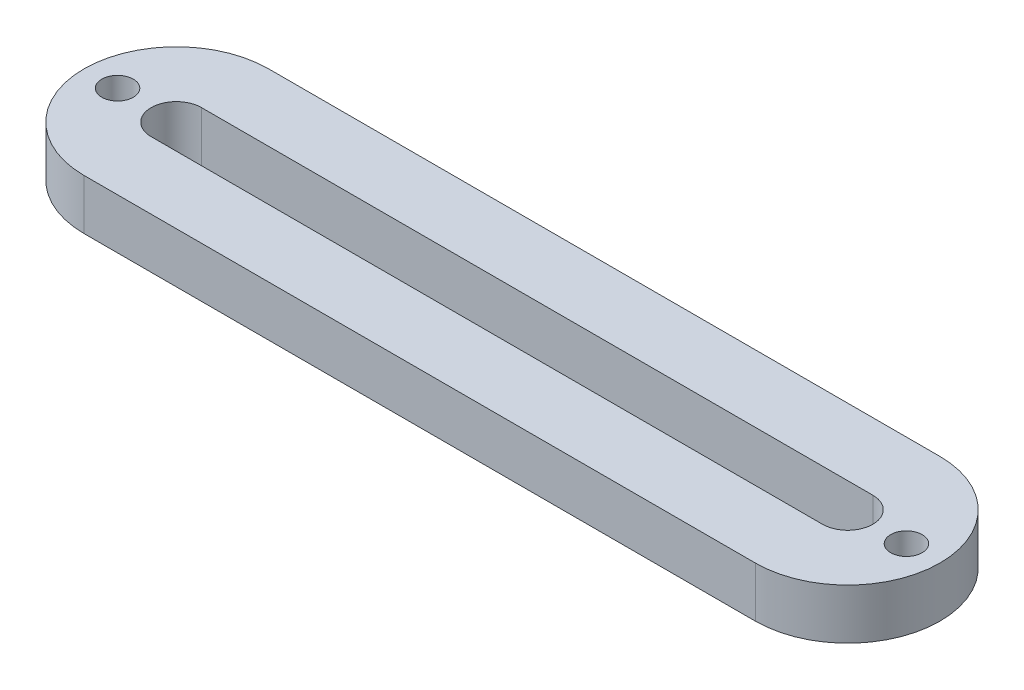
ISO-10303-21;
HEADER;
FILE_DESCRIPTION(('STEP AP214'),'2;1');
FILE_NAME('part.step','',(''),(''),'','','');
FILE_SCHEMA(('AUTOMOTIVE_DESIGN { 1 0 10303 214 1 1 1 1 }'));
ENDSEC;
DATA;
#1=APPLICATION_CONTEXT('core data for automotive mechanical design processes');
#2=APPLICATION_PROTOCOL_DEFINITION('international standard','automotive_design',2000,#1);
#3=PRODUCT_CONTEXT('',#1,'mechanical');
#4=PRODUCT('Part','Part','',(#3));
#5=PRODUCT_RELATED_PRODUCT_CATEGORY('part','',(#4));
#6=PRODUCT_DEFINITION_FORMATION('','',#4);
#7=PRODUCT_DEFINITION_CONTEXT('part definition',#1,'design');
#8=PRODUCT_DEFINITION('design','',#6,#7);
#9=PRODUCT_DEFINITION_SHAPE('','',#8);
#10=(LENGTH_UNIT() NAMED_UNIT(*) SI_UNIT(.MILLI.,.METRE.));
#11=(NAMED_UNIT(*) PLANE_ANGLE_UNIT() SI_UNIT($,.RADIAN.));
#12=(NAMED_UNIT(*) SI_UNIT($,.STERADIAN.) SOLID_ANGLE_UNIT());
#13=UNCERTAINTY_MEASURE_WITH_UNIT(LENGTH_MEASURE(1.E-05),#10,'distance_accuracy_value','');
#14=(GEOMETRIC_REPRESENTATION_CONTEXT(3) GLOBAL_UNCERTAINTY_ASSIGNED_CONTEXT((#13)) GLOBAL_UNIT_ASSIGNED_CONTEXT((#10,
#11,#12)) REPRESENTATION_CONTEXT('',''));
#15=CARTESIAN_POINT('',(0.,0.,0.));
#16=DIRECTION('',(0.,0.,1.));
#17=DIRECTION('',(1.,0.,0.));
#18=AXIS2_PLACEMENT_3D('',#15,#16,#17);
#19=CARTESIAN_POINT('',(-40.,6.,0.));
#20=DIRECTION('',(0.,1.,0.));
#21=DIRECTION('',(0.,0.,1.));
#22=AXIS2_PLACEMENT_3D('',#19,#20,#21);
#23=PLANE('',#22);
#24=CARTESIAN_POINT('',(-47.,6.,0.));
#25=DIRECTION('',(0.,1.,0.));
#26=DIRECTION('',(0.,0.,1.));
#27=AXIS2_PLACEMENT_3D('',#24,#25,#26);
#28=CIRCLE('',#27,1.875);
#29=CARTESIAN_POINT('',(-47.,6.,1.875));
#30=VERTEX_POINT('',#29);
#31=EDGE_CURVE('E126',#30,#30,#28,.T.);
#32=ORIENTED_EDGE('',*,*,#31,.F.);
#33=EDGE_LOOP('',(#32));
#34=FACE_BOUND('',#33,.T.);
#35=CARTESIAN_POINT('',(-40.,6.,0.));
#36=DIRECTION('',(0.,1.,0.));
#37=DIRECTION('',(0.,0.,1.));
#38=AXIS2_PLACEMENT_3D('',#35,#36,#37);
#39=CIRCLE('',#38,11.);
#40=CARTESIAN_POINT('',(-40.,6.,-11.));
#41=VERTEX_POINT('',#40);
#42=CARTESIAN_POINT('',(-40.,6.,11.));
#43=VERTEX_POINT('',#42);
#44=EDGE_CURVE('E136',#41,#43,#39,.T.);
#45=ORIENTED_EDGE('',*,*,#44,.T.);
#46=DIRECTION('',(1.,0.,0.));
#47=VECTOR('',#46,1.);
#48=CARTESIAN_POINT('',(-40.,6.,11.));
#49=LINE('',#48,#47);
#50=CARTESIAN_POINT('',(40.,6.,11.));
#51=VERTEX_POINT('',#50);
#52=EDGE_CURVE('E139',#43,#51,#49,.T.);
#53=ORIENTED_EDGE('',*,*,#52,.T.);
#54=CARTESIAN_POINT('',(40.,6.,0.));
#55=DIRECTION('',(0.,1.,0.));
#56=DIRECTION('',(0.,0.,1.));
#57=AXIS2_PLACEMENT_3D('',#54,#55,#56);
#58=CIRCLE('',#57,11.);
#59=CARTESIAN_POINT('',(40.,6.,-11.));
#60=VERTEX_POINT('',#59);
#61=EDGE_CURVE('E142',#51,#60,#58,.T.);
#62=ORIENTED_EDGE('',*,*,#61,.T.);
#63=DIRECTION('',(-1.,0.,0.));
#64=VECTOR('',#63,1.);
#65=CARTESIAN_POINT('',(-40.,6.,-11.));
#66=LINE('',#65,#64);
#67=EDGE_CURVE('E144',#60,#41,#66,.T.);
#68=ORIENTED_EDGE('',*,*,#67,.T.);
#69=EDGE_LOOP('',(#45,#53,#62,#68));
#70=FACE_BOUND('',#69,.T.);
#71=DIRECTION('',(1.,0.,0.));
#72=VECTOR('',#71,1.);
#73=CARTESIAN_POINT('',(-40.,6.,3.));
#74=LINE('',#73,#72);
#75=CARTESIAN_POINT('',(-40.,6.,3.));
#76=VERTEX_POINT('',#75);
#77=CARTESIAN_POINT('',(40.,6.,2.99999999999999));
#78=VERTEX_POINT('',#77);
#79=EDGE_CURVE('E105',#76,#78,#74,.T.);
#80=ORIENTED_EDGE('',*,*,#79,.F.);
#81=CARTESIAN_POINT('',(-40.,6.,0.));
#82=DIRECTION('',(0.,1.,0.));
#83=DIRECTION('',(0.,0.,1.));
#84=AXIS2_PLACEMENT_3D('',#81,#82,#83);
#85=CIRCLE('',#84,3.);
#86=CARTESIAN_POINT('',(-40.,6.,-3.));
#87=VERTEX_POINT('',#86);
#88=EDGE_CURVE('E97',#87,#76,#85,.T.);
#89=ORIENTED_EDGE('',*,*,#88,.F.);
#90=DIRECTION('',(-1.,0.,0.));
#91=VECTOR('',#90,1.);
#92=CARTESIAN_POINT('',(-40.,6.,-3.));
#93=LINE('',#92,#91);
#94=CARTESIAN_POINT('',(40.,6.,-3.00000000000001));
#95=VERTEX_POINT('',#94);
#96=EDGE_CURVE('E120',#95,#87,#93,.T.);
#97=ORIENTED_EDGE('',*,*,#96,.F.);
#98=CARTESIAN_POINT('',(40.,6.,0.));
#99=DIRECTION('',(0.,1.,0.));
#100=DIRECTION('',(0.,0.,1.));
#101=AXIS2_PLACEMENT_3D('',#98,#99,#100);
#102=CIRCLE('',#101,3.);
#103=EDGE_CURVE('E118',#78,#95,#102,.T.);
#104=ORIENTED_EDGE('',*,*,#103,.F.);
#105=EDGE_LOOP('',(#80,#89,#97,#104));
#106=FACE_BOUND('',#105,.T.);
#107=CARTESIAN_POINT('',(47.,6.,0.));
#108=DIRECTION('',(0.,1.,0.));
#109=DIRECTION('',(0.,0.,-1.));
#110=AXIS2_PLACEMENT_3D('',#107,#108,#109);
#111=CIRCLE('',#110,1.875);
#112=CARTESIAN_POINT('',(47.,6.,-1.87500000000001));
#113=VERTEX_POINT('',#112);
#114=EDGE_CURVE('E226',#113,#113,#111,.T.);
#115=ORIENTED_EDGE('',*,*,#114,.F.);
#116=EDGE_LOOP('',(#115));
#117=FACE_BOUND('',#116,.T.);
#118=ADVANCED_FACE('F32',(#34,#70,#106,#117),#23,.T.);
#119=CARTESIAN_POINT('',(-40.,0.,0.));
#120=DIRECTION('',(0.,1.,0.));
#121=DIRECTION('',(0.,0.,1.));
#122=AXIS2_PLACEMENT_3D('',#119,#120,#121);
#123=PLANE('',#122);
#124=CARTESIAN_POINT('',(-40.,0.,0.));
#125=DIRECTION('',(0.,1.,0.));
#126=DIRECTION('',(0.,0.,1.));
#127=AXIS2_PLACEMENT_3D('',#124,#125,#126);
#128=CIRCLE('',#127,11.);
#129=CARTESIAN_POINT('',(-40.,0.,-11.));
#130=VERTEX_POINT('',#129);
#131=CARTESIAN_POINT('',(-40.,0.,11.));
#132=VERTEX_POINT('',#131);
#133=EDGE_CURVE('E113',#130,#132,#128,.T.);
#134=ORIENTED_EDGE('',*,*,#133,.F.);
#135=DIRECTION('',(-1.,0.,0.));
#136=VECTOR('',#135,1.);
#137=CARTESIAN_POINT('',(-40.,0.,-11.));
#138=LINE('',#137,#136);
#139=CARTESIAN_POINT('',(40.,0.,-11.));
#140=VERTEX_POINT('',#139);
#141=EDGE_CURVE('E140',#140,#130,#138,.T.);
#142=ORIENTED_EDGE('',*,*,#141,.F.);
#143=CARTESIAN_POINT('',(40.,0.,0.));
#144=DIRECTION('',(0.,1.,0.));
#145=DIRECTION('',(0.,0.,1.));
#146=AXIS2_PLACEMENT_3D('',#143,#144,#145);
#147=CIRCLE('',#146,11.);
#148=CARTESIAN_POINT('',(40.,0.,11.));
#149=VERTEX_POINT('',#148);
#150=EDGE_CURVE('E151',#149,#140,#147,.T.);
#151=ORIENTED_EDGE('',*,*,#150,.F.);
#152=DIRECTION('',(1.,0.,0.));
#153=VECTOR('',#152,1.);
#154=CARTESIAN_POINT('',(-40.,0.,11.));
#155=LINE('',#154,#153);
#156=EDGE_CURVE('E149',#132,#149,#155,.T.);
#157=ORIENTED_EDGE('',*,*,#156,.F.);
#158=EDGE_LOOP('',(#134,#142,#151,#157));
#159=FACE_BOUND('',#158,.T.);
#160=CARTESIAN_POINT('',(-40.,0.,0.));
#161=DIRECTION('',(0.,1.,0.));
#162=DIRECTION('',(0.,0.,1.));
#163=AXIS2_PLACEMENT_3D('',#160,#161,#162);
#164=CIRCLE('',#163,3.);
#165=CARTESIAN_POINT('',(-40.,0.,-3.));
#166=VERTEX_POINT('',#165);
#167=CARTESIAN_POINT('',(-40.,0.,3.));
#168=VERTEX_POINT('',#167);
#169=EDGE_CURVE('E55',#166,#168,#164,.T.);
#170=ORIENTED_EDGE('',*,*,#169,.T.);
#171=DIRECTION('',(1.,0.,0.));
#172=VECTOR('',#171,1.);
#173=CARTESIAN_POINT('',(-40.,0.,3.));
#174=LINE('',#173,#172);
#175=CARTESIAN_POINT('',(40.,0.,2.99999999999999));
#176=VERTEX_POINT('',#175);
#177=EDGE_CURVE('E112',#168,#176,#174,.T.);
#178=ORIENTED_EDGE('',*,*,#177,.T.);
#179=CARTESIAN_POINT('',(40.,0.,0.));
#180=DIRECTION('',(0.,1.,0.));
#181=DIRECTION('',(0.,0.,1.));
#182=AXIS2_PLACEMENT_3D('',#179,#180,#181);
#183=CIRCLE('',#182,3.);
#184=CARTESIAN_POINT('',(40.,0.,-3.00000000000001));
#185=VERTEX_POINT('',#184);
#186=EDGE_CURVE('E128',#176,#185,#183,.T.);
#187=ORIENTED_EDGE('',*,*,#186,.T.);
#188=DIRECTION('',(-1.,0.,0.));
#189=VECTOR('',#188,1.);
#190=CARTESIAN_POINT('',(-40.,0.,-3.));
#191=LINE('',#190,#189);
#192=EDGE_CURVE('E106',#185,#166,#191,.T.);
#193=ORIENTED_EDGE('',*,*,#192,.T.);
#194=EDGE_LOOP('',(#170,#178,#187,#193));
#195=FACE_BOUND('',#194,.T.);
#196=CARTESIAN_POINT('',(-47.,0.,0.));
#197=DIRECTION('',(0.,1.,0.));
#198=DIRECTION('',(0.,0.,1.));
#199=AXIS2_PLACEMENT_3D('',#196,#197,#198);
#200=CIRCLE('',#199,1.875);
#201=CARTESIAN_POINT('',(-47.,0.,1.875));
#202=VERTEX_POINT('',#201);
#203=EDGE_CURVE('E232',#202,#202,#200,.T.);
#204=ORIENTED_EDGE('',*,*,#203,.T.);
#205=EDGE_LOOP('',(#204));
#206=FACE_BOUND('',#205,.T.);
#207=CARTESIAN_POINT('',(47.,0.,0.));
#208=DIRECTION('',(0.,1.,0.));
#209=DIRECTION('',(0.,0.,-1.));
#210=AXIS2_PLACEMENT_3D('',#207,#208,#209);
#211=CIRCLE('',#210,1.875);
#212=CARTESIAN_POINT('',(47.,0.,-1.87500000000001));
#213=VERTEX_POINT('',#212);
#214=EDGE_CURVE('E229',#213,#213,#211,.T.);
#215=ORIENTED_EDGE('',*,*,#214,.T.);
#216=EDGE_LOOP('',(#215));
#217=FACE_BOUND('',#216,.T.);
#218=ADVANCED_FACE('F169',(#159,#195,#206,#217),#123,.F.);
#219=CARTESIAN_POINT('',(-40.,6.,0.));
#220=DIRECTION('',(0.,-1.,0.));
#221=DIRECTION('',(0.,0.,-1.));
#222=AXIS2_PLACEMENT_3D('',#219,#220,#221);
#223=CYLINDRICAL_SURFACE('',#222,11.);
#224=ORIENTED_EDGE('',*,*,#133,.T.);
#225=DIRECTION('',(0.,-1.,0.));
#226=VECTOR('',#225,1.);
#227=CARTESIAN_POINT('',(-40.,6.,11.));
#228=LINE('',#227,#226);
#229=EDGE_CURVE('E11',#43,#132,#228,.T.);
#230=ORIENTED_EDGE('',*,*,#229,.F.);
#231=ORIENTED_EDGE('',*,*,#44,.F.);
#232=DIRECTION('',(0.,-1.,0.));
#233=VECTOR('',#232,1.);
#234=CARTESIAN_POINT('',(-40.,6.,-11.));
#235=LINE('',#234,#233);
#236=EDGE_CURVE('E146',#41,#130,#235,.T.);
#237=ORIENTED_EDGE('',*,*,#236,.T.);
#238=EDGE_LOOP('',(#224,#230,#231,#237));
#239=FACE_BOUND('',#238,.T.);
#240=ADVANCED_FACE('F34',(#239),#223,.T.);
#241=CARTESIAN_POINT('',(-40.,6.,11.));
#242=DIRECTION('',(0.,0.,-1.));
#243=DIRECTION('',(-1.,0.,0.));
#244=AXIS2_PLACEMENT_3D('',#241,#242,#243);
#245=PLANE('',#244);
#246=ORIENTED_EDGE('',*,*,#156,.T.);
#247=DIRECTION('',(0.,-1.,0.));
#248=VECTOR('',#247,1.);
#249=CARTESIAN_POINT('',(40.,6.,11.));
#250=LINE('',#249,#248);
#251=EDGE_CURVE('E40',#51,#149,#250,.T.);
#252=ORIENTED_EDGE('',*,*,#251,.F.);
#253=ORIENTED_EDGE('',*,*,#52,.F.);
#254=ORIENTED_EDGE('',*,*,#229,.T.);
#255=EDGE_LOOP('',(#246,#252,#253,#254));
#256=FACE_BOUND('',#255,.T.);
#257=ADVANCED_FACE('F179',(#256),#245,.F.);
#258=CARTESIAN_POINT('',(40.,6.,0.));
#259=DIRECTION('',(0.,-1.,0.));
#260=DIRECTION('',(0.,0.,-1.));
#261=AXIS2_PLACEMENT_3D('',#258,#259,#260);
#262=CYLINDRICAL_SURFACE('',#261,11.);
#263=ORIENTED_EDGE('',*,*,#150,.T.);
#264=DIRECTION('',(0.,-1.,0.));
#265=VECTOR('',#264,1.);
#266=CARTESIAN_POINT('',(40.,6.,-11.));
#267=LINE('',#266,#265);
#268=EDGE_CURVE('E156',#60,#140,#267,.T.);
#269=ORIENTED_EDGE('',*,*,#268,.F.);
#270=ORIENTED_EDGE('',*,*,#61,.F.);
#271=ORIENTED_EDGE('',*,*,#251,.T.);
#272=EDGE_LOOP('',(#263,#269,#270,#271));
#273=FACE_BOUND('',#272,.T.);
#274=ADVANCED_FACE('F163',(#273),#262,.T.);
#275=CARTESIAN_POINT('',(-40.,6.,-11.));
#276=DIRECTION('',(0.,0.,1.));
#277=DIRECTION('',(1.,0.,0.));
#278=AXIS2_PLACEMENT_3D('',#275,#276,#277);
#279=PLANE('',#278);
#280=ORIENTED_EDGE('',*,*,#141,.T.);
#281=ORIENTED_EDGE('',*,*,#236,.F.);
#282=ORIENTED_EDGE('',*,*,#67,.F.);
#283=ORIENTED_EDGE('',*,*,#268,.T.);
#284=EDGE_LOOP('',(#280,#281,#282,#283));
#285=FACE_BOUND('',#284,.T.);
#286=ADVANCED_FACE('F173',(#285),#279,.F.);
#287=CARTESIAN_POINT('',(-40.,6.,0.));
#288=DIRECTION('',(0.,-1.,0.));
#289=DIRECTION('',(0.,0.,-1.));
#290=AXIS2_PLACEMENT_3D('',#287,#288,#289);
#291=CYLINDRICAL_SURFACE('',#290,3.);
#292=ORIENTED_EDGE('',*,*,#169,.F.);
#293=DIRECTION('',(0.,-1.,0.));
#294=VECTOR('',#293,1.);
#295=CARTESIAN_POINT('',(-40.,6.,-3.));
#296=LINE('',#295,#294);
#297=EDGE_CURVE('E101',#87,#166,#296,.T.);
#298=ORIENTED_EDGE('',*,*,#297,.F.);
#299=ORIENTED_EDGE('',*,*,#88,.T.);
#300=DIRECTION('',(0.,-1.,0.));
#301=VECTOR('',#300,1.);
#302=CARTESIAN_POINT('',(-40.,6.,3.));
#303=LINE('',#302,#301);
#304=EDGE_CURVE('E100',#76,#168,#303,.T.);
#305=ORIENTED_EDGE('',*,*,#304,.T.);
#306=EDGE_LOOP('',(#292,#298,#299,#305));
#307=FACE_BOUND('',#306,.T.);
#308=ADVANCED_FACE('F99',(#307),#291,.F.);
#309=CARTESIAN_POINT('',(-40.,6.,3.));
#310=DIRECTION('',(0.,0.,-1.));
#311=DIRECTION('',(-1.,0.,0.));
#312=AXIS2_PLACEMENT_3D('',#309,#310,#311);
#313=PLANE('',#312);
#314=ORIENTED_EDGE('',*,*,#177,.F.);
#315=ORIENTED_EDGE('',*,*,#304,.F.);
#316=ORIENTED_EDGE('',*,*,#79,.T.);
#317=DIRECTION('',(0.,-1.,0.));
#318=VECTOR('',#317,1.);
#319=CARTESIAN_POINT('',(40.,6.,2.99999999999999));
#320=LINE('',#319,#318);
#321=EDGE_CURVE('E114',#78,#176,#320,.T.);
#322=ORIENTED_EDGE('',*,*,#321,.T.);
#323=EDGE_LOOP('',(#314,#315,#316,#322));
#324=FACE_BOUND('',#323,.T.);
#325=ADVANCED_FACE('F109',(#324),#313,.T.);
#326=CARTESIAN_POINT('',(40.,6.,0.));
#327=DIRECTION('',(0.,-1.,0.));
#328=DIRECTION('',(0.,0.,-1.));
#329=AXIS2_PLACEMENT_3D('',#326,#327,#328);
#330=CYLINDRICAL_SURFACE('',#329,3.);
#331=ORIENTED_EDGE('',*,*,#186,.F.);
#332=ORIENTED_EDGE('',*,*,#321,.F.);
#333=ORIENTED_EDGE('',*,*,#103,.T.);
#334=DIRECTION('',(0.,-1.,0.));
#335=VECTOR('',#334,1.);
#336=CARTESIAN_POINT('',(40.,6.,-3.00000000000001));
#337=LINE('',#336,#335);
#338=EDGE_CURVE('E47',#95,#185,#337,.T.);
#339=ORIENTED_EDGE('',*,*,#338,.T.);
#340=EDGE_LOOP('',(#331,#332,#333,#339));
#341=FACE_BOUND('',#340,.T.);
#342=ADVANCED_FACE('F204',(#341),#330,.F.);
#343=CARTESIAN_POINT('',(-40.,6.,-3.));
#344=DIRECTION('',(0.,0.,1.));
#345=DIRECTION('',(1.,0.,0.));
#346=AXIS2_PLACEMENT_3D('',#343,#344,#345);
#347=PLANE('',#346);
#348=ORIENTED_EDGE('',*,*,#192,.F.);
#349=ORIENTED_EDGE('',*,*,#338,.F.);
#350=ORIENTED_EDGE('',*,*,#96,.T.);
#351=ORIENTED_EDGE('',*,*,#297,.T.);
#352=EDGE_LOOP('',(#348,#349,#350,#351));
#353=FACE_BOUND('',#352,.T.);
#354=ADVANCED_FACE('F208',(#353),#347,.T.);
#355=CARTESIAN_POINT('',(-47.,6.,0.));
#356=DIRECTION('',(0.,-1.,0.));
#357=DIRECTION('',(0.,0.,-1.));
#358=AXIS2_PLACEMENT_3D('',#355,#356,#357);
#359=CYLINDRICAL_SURFACE('',#358,1.875);
#360=ORIENTED_EDGE('',*,*,#31,.T.);
#361=EDGE_LOOP('',(#360));
#362=FACE_BOUND('',#361,.T.);
#363=ORIENTED_EDGE('',*,*,#203,.F.);
#364=EDGE_LOOP('',(#363));
#365=FACE_BOUND('',#364,.T.);
#366=ADVANCED_FACE('F214',(#362,#365),#359,.F.);
#367=CARTESIAN_POINT('',(47.,6.,0.));
#368=DIRECTION('',(0.,-1.,0.));
#369=DIRECTION('',(0.,0.,-1.));
#370=AXIS2_PLACEMENT_3D('',#367,#368,#369);
#371=CYLINDRICAL_SURFACE('',#370,1.875);
#372=ORIENTED_EDGE('',*,*,#114,.T.);
#373=EDGE_LOOP('',(#372));
#374=FACE_BOUND('',#373,.T.);
#375=ORIENTED_EDGE('',*,*,#214,.F.);
#376=EDGE_LOOP('',(#375));
#377=FACE_BOUND('',#376,.T.);
#378=ADVANCED_FACE('F217',(#374,#377),#371,.F.);
#379=CLOSED_SHELL('',(#118,#218,#240,#257,#274,#286,#308,#325,#342,#354,#366,#378));
#380=MANIFOLD_SOLID_BREP('B2',#379);
#381=ADVANCED_BREP_SHAPE_REPRESENTATION('',(#18,#380),#14);
#382=SHAPE_DEFINITION_REPRESENTATION(#9,#381);
ENDSEC;
END-ISO-10303-21;
